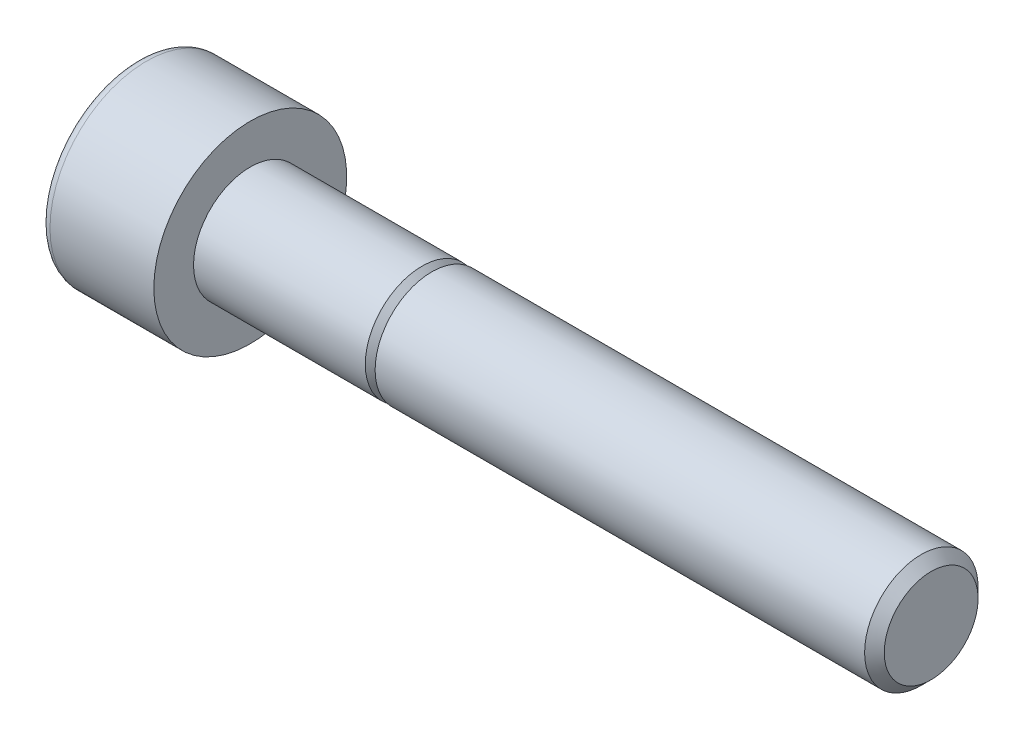
ISO-10303-21;
HEADER;
FILE_DESCRIPTION(('STEP AP214'),'2;1');
FILE_NAME('part.step','',(''),(''),'','','');
FILE_SCHEMA(('AUTOMOTIVE_DESIGN { 1 0 10303 214 1 1 1 1 }'));
ENDSEC;
DATA;
#1=APPLICATION_CONTEXT('core data for automotive mechanical design processes');
#2=APPLICATION_PROTOCOL_DEFINITION('international standard','automotive_design',2000,#1);
#3=PRODUCT_CONTEXT('',#1,'mechanical');
#4=PRODUCT('Part','Part','',(#3));
#5=PRODUCT_RELATED_PRODUCT_CATEGORY('part','',(#4));
#6=PRODUCT_DEFINITION_FORMATION('','',#4);
#7=PRODUCT_DEFINITION_CONTEXT('part definition',#1,'design');
#8=PRODUCT_DEFINITION('design','',#6,#7);
#9=PRODUCT_DEFINITION_SHAPE('','',#8);
#10=(LENGTH_UNIT() NAMED_UNIT(*) SI_UNIT(.MILLI.,.METRE.));
#11=(NAMED_UNIT(*) PLANE_ANGLE_UNIT() SI_UNIT($,.RADIAN.));
#12=(NAMED_UNIT(*) SI_UNIT($,.STERADIAN.) SOLID_ANGLE_UNIT());
#13=UNCERTAINTY_MEASURE_WITH_UNIT(LENGTH_MEASURE(1.E-05),#10,'distance_accuracy_value','');
#14=(GEOMETRIC_REPRESENTATION_CONTEXT(3) GLOBAL_UNCERTAINTY_ASSIGNED_CONTEXT((#13)) GLOBAL_UNIT_ASSIGNED_CONTEXT((#10,
#11,#12)) REPRESENTATION_CONTEXT('',''));
#15=CARTESIAN_POINT('',(0.,0.,0.));
#16=DIRECTION('',(0.,0.,1.));
#17=DIRECTION('',(1.,0.,0.));
#18=AXIS2_PLACEMENT_3D('',#15,#16,#17);
#19=CARTESIAN_POINT('',(0.,0.,0.));
#20=DIRECTION('',(-1.,0.,0.));
#21=DIRECTION('',(0.,0.,1.));
#22=AXIS2_PLACEMENT_3D('',#19,#20,#21);
#23=PLANE('',#22);
#24=CARTESIAN_POINT('',(0.,0.,0.));
#25=DIRECTION('',(-1.,0.,0.));
#26=DIRECTION('',(0.,0.,1.));
#27=AXIS2_PLACEMENT_3D('',#24,#25,#26);
#28=CIRCLE('',#27,4.25);
#29=CARTESIAN_POINT('',(0.,0.,4.25));
#30=VERTEX_POINT('',#29);
#31=EDGE_CURVE('E109',#30,#30,#28,.T.);
#32=ORIENTED_EDGE('',*,*,#31,.F.);
#33=EDGE_LOOP('',(#32));
#34=FACE_BOUND('',#33,.T.);
#35=CARTESIAN_POINT('',(0.,0.,0.));
#36=DIRECTION('',(-1.,0.,0.));
#37=DIRECTION('',(0.,0.,1.));
#38=AXIS2_PLACEMENT_3D('',#35,#36,#37);
#39=CIRCLE('',#38,2.5);
#40=CARTESIAN_POINT('',(0.,0.,2.5));
#41=VERTEX_POINT('',#40);
#42=EDGE_CURVE('E11',#41,#41,#39,.F.);
#43=ORIENTED_EDGE('',*,*,#42,.F.);
#44=EDGE_LOOP('',(#43));
#45=FACE_BOUND('',#44,.T.);
#46=ADVANCED_FACE('F16',(#34,#45),#23,.F.);
#47=CARTESIAN_POINT('',(-5.,3.825,0.));
#48=DIRECTION('',(1.,0.,0.));
#49=DIRECTION('',(0.,0.,-1.));
#50=AXIS2_PLACEMENT_3D('',#47,#48,#49);
#51=PLANE('',#50);
#52=CARTESIAN_POINT('',(-5.,0.,0.));
#53=DIRECTION('',(-1.,0.,0.));
#54=DIRECTION('',(0.,0.,1.));
#55=AXIS2_PLACEMENT_3D('',#52,#53,#54);
#56=CIRCLE('',#55,3.825);
#57=CARTESIAN_POINT('',(-5.,0.,3.825));
#58=VERTEX_POINT('',#57);
#59=EDGE_CURVE('E91',#58,#58,#56,.T.);
#60=ORIENTED_EDGE('',*,*,#59,.T.);
#61=EDGE_LOOP('',(#60));
#62=FACE_BOUND('',#61,.T.);
#63=DIRECTION('',(0.,0.5,0.866025403784438));
#64=VECTOR('',#63,1.);
#65=CARTESIAN_POINT('',(-5.,-0.775800807568874,2.65627358473774));
#66=LINE('',#65,#64);
#67=CARTESIAN_POINT('',(-5.,-2.30940107675851,0.));
#68=VERTEX_POINT('',#67);
#69=CARTESIAN_POINT('',(-5.,-1.15470053837925,2.));
#70=VERTEX_POINT('',#69);
#71=EDGE_CURVE('E25',#68,#70,#66,.T.);
#72=ORIENTED_EDGE('',*,*,#71,.F.);
#73=DIRECTION('',(0.,-0.5,0.866025403784439));
#74=VECTOR('',#73,1.);
#75=CARTESIAN_POINT('',(-5.,-0.775800807568879,-2.65627358473774));
#76=LINE('',#75,#74);
#77=CARTESIAN_POINT('',(-5.,-1.15470053837925,-2.));
#78=VERTEX_POINT('',#77);
#79=EDGE_CURVE('E40',#78,#68,#76,.T.);
#80=ORIENTED_EDGE('',*,*,#79,.F.);
#81=DIRECTION('',(0.,-1.,0.));
#82=VECTOR('',#81,1.);
#83=CARTESIAN_POINT('',(-5.,3.825,-2.));
#84=LINE('',#83,#82);
#85=CARTESIAN_POINT('',(-5.,1.15470053837925,-2.));
#86=VERTEX_POINT('',#85);
#87=EDGE_CURVE('E122',#86,#78,#84,.T.);
#88=ORIENTED_EDGE('',*,*,#87,.F.);
#89=DIRECTION('',(0.,-0.5,-0.866025403784439));
#90=VECTOR('',#89,1.);
#91=CARTESIAN_POINT('',(-5.,2.68830080756888,0.656273584737739));
#92=LINE('',#91,#90);
#93=CARTESIAN_POINT('',(-5.,2.30940107675851,0.));
#94=VERTEX_POINT('',#93);
#95=EDGE_CURVE('E119',#94,#86,#92,.T.);
#96=ORIENTED_EDGE('',*,*,#95,.F.);
#97=DIRECTION('',(0.,0.5,-0.866025403784439));
#98=VECTOR('',#97,1.);
#99=CARTESIAN_POINT('',(-5.,2.68830080756888,-0.656273584737739));
#100=LINE('',#99,#98);
#101=CARTESIAN_POINT('',(-5.,1.15470053837925,2.));
#102=VERTEX_POINT('',#101);
#103=EDGE_CURVE('E116',#102,#94,#100,.T.);
#104=ORIENTED_EDGE('',*,*,#103,.F.);
#105=DIRECTION('',(0.,1.,0.));
#106=VECTOR('',#105,1.);
#107=CARTESIAN_POINT('',(-5.,3.825,2.));
#108=LINE('',#107,#106);
#109=EDGE_CURVE('E113',#70,#102,#108,.T.);
#110=ORIENTED_EDGE('',*,*,#109,.F.);
#111=EDGE_LOOP('',(#72,#80,#88,#96,#104,#110));
#112=FACE_BOUND('',#111,.T.);
#113=ADVANCED_FACE('F18',(#62,#112),#51,.F.);
#114=CARTESIAN_POINT('',(-5.,0.,0.));
#115=DIRECTION('',(-1.,0.,0.));
#116=DIRECTION('',(0.,0.,1.));
#117=AXIS2_PLACEMENT_3D('',#114,#115,#116);
#118=CYLINDRICAL_SURFACE('',#117,4.25);
#119=CARTESIAN_POINT('',(-4.575,0.,0.));
#120=DIRECTION('',(-1.,0.,0.));
#121=DIRECTION('',(0.,0.,1.));
#122=AXIS2_PLACEMENT_3D('',#119,#120,#121);
#123=CIRCLE('',#122,4.25);
#124=CARTESIAN_POINT('',(-4.575,0.,4.25));
#125=VERTEX_POINT('',#124);
#126=EDGE_CURVE('E99',#125,#125,#123,.T.);
#127=ORIENTED_EDGE('',*,*,#126,.F.);
#128=EDGE_LOOP('',(#127));
#129=FACE_BOUND('',#128,.T.);
#130=ORIENTED_EDGE('',*,*,#31,.T.);
#131=EDGE_LOOP('',(#130));
#132=FACE_BOUND('',#131,.T.);
#133=ADVANCED_FACE('F238',(#129,#132),#118,.T.);
#134=CARTESIAN_POINT('',(-4.575,0.,0.));
#135=DIRECTION('',(-1.,0.,0.));
#136=DIRECTION('',(0.,0.,1.));
#137=AXIS2_PLACEMENT_3D('',#134,#135,#136);
#138=TOROIDAL_SURFACE('',#137,3.825,0.425);
#139=ORIENTED_EDGE('',*,*,#59,.F.);
#140=EDGE_LOOP('',(#139));
#141=FACE_BOUND('',#140,.T.);
#142=ORIENTED_EDGE('',*,*,#126,.T.);
#143=EDGE_LOOP('',(#142));
#144=FACE_BOUND('',#143,.T.);
#145=ADVANCED_FACE('F245',(#141,#144),#138,.T.);
#146=CARTESIAN_POINT('',(-2.5,-1.15470053837925,2.));
#147=DIRECTION('',(0.,0.866025403784438,-0.5));
#148=DIRECTION('',(0.,0.5,0.866025403784438));
#149=AXIS2_PLACEMENT_3D('',#146,#147,#148);
#150=PLANE('',#149);
#151=ORIENTED_EDGE('',*,*,#71,.T.);
#152=DIRECTION('',(-1.,0.,0.));
#153=VECTOR('',#152,1.);
#154=CARTESIAN_POINT('',(-2.5,-1.15470053837925,2.));
#155=LINE('',#154,#153);
#156=CARTESIAN_POINT('',(-2.5,-1.15470053837925,2.));
#157=VERTEX_POINT('',#156);
#158=EDGE_CURVE('E32',#157,#70,#155,.T.);
#159=ORIENTED_EDGE('',*,*,#158,.F.);
#160=DIRECTION('',(0.,-0.5,-0.866025403784439));
#161=VECTOR('',#160,1.);
#162=CARTESIAN_POINT('',(-2.5,-1.15470053837925,2.));
#163=LINE('',#162,#161);
#164=CARTESIAN_POINT('',(-2.5,-2.30940107675851,0.));
#165=VERTEX_POINT('',#164);
#166=EDGE_CURVE('E76',#157,#165,#163,.T.);
#167=ORIENTED_EDGE('',*,*,#166,.T.);
#168=DIRECTION('',(-1.,0.,0.));
#169=VECTOR('',#168,1.);
#170=CARTESIAN_POINT('',(-2.5,-2.30940107675851,0.));
#171=LINE('',#170,#169);
#172=EDGE_CURVE('E84',#165,#68,#171,.T.);
#173=ORIENTED_EDGE('',*,*,#172,.T.);
#174=EDGE_LOOP('',(#151,#159,#167,#173));
#175=FACE_BOUND('',#174,.T.);
#176=ADVANCED_FACE('F83',(#175),#150,.T.);
#177=CARTESIAN_POINT('',(-2.5,-2.30940107675851,0.));
#178=DIRECTION('',(0.,0.866025403784439,0.5));
#179=DIRECTION('',(0.,-0.5,0.866025403784439));
#180=AXIS2_PLACEMENT_3D('',#177,#178,#179);
#181=PLANE('',#180);
#182=ORIENTED_EDGE('',*,*,#79,.T.);
#183=ORIENTED_EDGE('',*,*,#172,.F.);
#184=DIRECTION('',(0.,0.5,-0.866025403784439));
#185=VECTOR('',#184,1.);
#186=CARTESIAN_POINT('',(-2.5,-2.30940107675851,0.));
#187=LINE('',#186,#185);
#188=CARTESIAN_POINT('',(-2.5,-1.15470053837925,-2.));
#189=VERTEX_POINT('',#188);
#190=EDGE_CURVE('E72',#165,#189,#187,.T.);
#191=ORIENTED_EDGE('',*,*,#190,.T.);
#192=DIRECTION('',(-1.,0.,0.));
#193=VECTOR('',#192,1.);
#194=CARTESIAN_POINT('',(-2.5,-1.15470053837925,-2.));
#195=LINE('',#194,#193);
#196=EDGE_CURVE('E92',#189,#78,#195,.T.);
#197=ORIENTED_EDGE('',*,*,#196,.T.);
#198=EDGE_LOOP('',(#182,#183,#191,#197));
#199=FACE_BOUND('',#198,.T.);
#200=ADVANCED_FACE('F89',(#199),#181,.T.);
#201=CARTESIAN_POINT('',(-2.5,-1.15470053837925,-2.));
#202=DIRECTION('',(0.,0.,1.));
#203=DIRECTION('',(0.,-1.,0.));
#204=AXIS2_PLACEMENT_3D('',#201,#202,#203);
#205=PLANE('',#204);
#206=ORIENTED_EDGE('',*,*,#87,.T.);
#207=ORIENTED_EDGE('',*,*,#196,.F.);
#208=DIRECTION('',(0.,1.,0.));
#209=VECTOR('',#208,1.);
#210=CARTESIAN_POINT('',(-2.5,-1.15470053837925,-2.));
#211=LINE('',#210,#209);
#212=CARTESIAN_POINT('',(-2.5,1.15470053837925,-2.));
#213=VERTEX_POINT('',#212);
#214=EDGE_CURVE('E78',#189,#213,#211,.T.);
#215=ORIENTED_EDGE('',*,*,#214,.T.);
#216=DIRECTION('',(-1.,0.,0.));
#217=VECTOR('',#216,1.);
#218=CARTESIAN_POINT('',(-2.5,1.15470053837925,-2.));
#219=LINE('',#218,#217);
#220=EDGE_CURVE('E102',#213,#86,#219,.T.);
#221=ORIENTED_EDGE('',*,*,#220,.T.);
#222=EDGE_LOOP('',(#206,#207,#215,#221));
#223=FACE_BOUND('',#222,.T.);
#224=ADVANCED_FACE('F161',(#223),#205,.T.);
#225=CARTESIAN_POINT('',(-2.5,1.15470053837925,-2.));
#226=DIRECTION('',(0.,-0.866025403784438,0.5));
#227=DIRECTION('',(0.,-0.5,-0.866025403784439));
#228=AXIS2_PLACEMENT_3D('',#225,#226,#227);
#229=PLANE('',#228);
#230=ORIENTED_EDGE('',*,*,#95,.T.);
#231=ORIENTED_EDGE('',*,*,#220,.F.);
#232=DIRECTION('',(0.,0.5,0.866025403784439));
#233=VECTOR('',#232,1.);
#234=CARTESIAN_POINT('',(-2.5,1.15470053837925,-2.));
#235=LINE('',#234,#233);
#236=CARTESIAN_POINT('',(-2.5,2.30940107675851,0.));
#237=VERTEX_POINT('',#236);
#238=EDGE_CURVE('E164',#213,#237,#235,.T.);
#239=ORIENTED_EDGE('',*,*,#238,.T.);
#240=DIRECTION('',(-1.,0.,0.));
#241=VECTOR('',#240,1.);
#242=CARTESIAN_POINT('',(-2.5,2.30940107675851,0.));
#243=LINE('',#242,#241);
#244=EDGE_CURVE('E143',#237,#94,#243,.T.);
#245=ORIENTED_EDGE('',*,*,#244,.T.);
#246=EDGE_LOOP('',(#230,#231,#239,#245));
#247=FACE_BOUND('',#246,.T.);
#248=ADVANCED_FACE('F163',(#247),#229,.T.);
#249=CARTESIAN_POINT('',(-2.5,2.30940107675851,0.));
#250=DIRECTION('',(0.,-0.866025403784439,-0.5));
#251=DIRECTION('',(0.,0.5,-0.866025403784439));
#252=AXIS2_PLACEMENT_3D('',#249,#250,#251);
#253=PLANE('',#252);
#254=ORIENTED_EDGE('',*,*,#103,.T.);
#255=ORIENTED_EDGE('',*,*,#244,.F.);
#256=DIRECTION('',(0.,-0.5,0.866025403784439));
#257=VECTOR('',#256,1.);
#258=CARTESIAN_POINT('',(-2.5,2.30940107675851,0.));
#259=LINE('',#258,#257);
#260=CARTESIAN_POINT('',(-2.5,1.15470053837925,2.));
#261=VERTEX_POINT('',#260);
#262=EDGE_CURVE('E141',#237,#261,#259,.T.);
#263=ORIENTED_EDGE('',*,*,#262,.T.);
#264=DIRECTION('',(-1.,0.,0.));
#265=VECTOR('',#264,1.);
#266=CARTESIAN_POINT('',(-2.5,1.15470053837925,2.));
#267=LINE('',#266,#265);
#268=EDGE_CURVE('E135',#261,#102,#267,.T.);
#269=ORIENTED_EDGE('',*,*,#268,.T.);
#270=EDGE_LOOP('',(#254,#255,#263,#269));
#271=FACE_BOUND('',#270,.T.);
#272=ADVANCED_FACE('F137',(#271),#253,.T.);
#273=CARTESIAN_POINT('',(-2.5,1.15470053837925,2.));
#274=DIRECTION('',(0.,0.,-1.));
#275=DIRECTION('',(0.,1.,0.));
#276=AXIS2_PLACEMENT_3D('',#273,#274,#275);
#277=PLANE('',#276);
#278=ORIENTED_EDGE('',*,*,#109,.T.);
#279=ORIENTED_EDGE('',*,*,#268,.F.);
#280=DIRECTION('',(0.,-1.,0.));
#281=VECTOR('',#280,1.);
#282=CARTESIAN_POINT('',(-2.5,1.15470053837925,2.));
#283=LINE('',#282,#281);
#284=EDGE_CURVE('E151',#261,#157,#283,.T.);
#285=ORIENTED_EDGE('',*,*,#284,.T.);
#286=ORIENTED_EDGE('',*,*,#158,.T.);
#287=EDGE_LOOP('',(#278,#279,#285,#286));
#288=FACE_BOUND('',#287,.T.);
#289=ADVANCED_FACE('F134',(#288),#277,.T.);
#290=CARTESIAN_POINT('',(-2.5,-2.30940107675851,0.));
#291=DIRECTION('',(1.,0.,0.));
#292=DIRECTION('',(0.,0.,1.));
#293=AXIS2_PLACEMENT_3D('',#290,#291,#292);
#294=PLANE('',#293);
#295=ORIENTED_EDGE('',*,*,#166,.F.);
#296=ORIENTED_EDGE('',*,*,#284,.F.);
#297=ORIENTED_EDGE('',*,*,#262,.F.);
#298=ORIENTED_EDGE('',*,*,#238,.F.);
#299=ORIENTED_EDGE('',*,*,#214,.F.);
#300=ORIENTED_EDGE('',*,*,#190,.F.);
#301=EDGE_LOOP('',(#295,#296,#297,#298,#299,#300));
#302=FACE_BOUND('',#301,.T.);
#303=ADVANCED_FACE('F74',(#302),#294,.F.);
#304=CARTESIAN_POINT('',(0.,0.,0.));
#305=DIRECTION('',(-1.,0.,0.));
#306=DIRECTION('',(0.,0.,1.));
#307=AXIS2_PLACEMENT_3D('',#304,#305,#306);
#308=CYLINDRICAL_SURFACE('',#307,2.5);
#309=CARTESIAN_POINT('',(7.567,0.,0.));
#310=DIRECTION('',(-1.,0.,0.));
#311=DIRECTION('',(0.,0.,1.));
#312=AXIS2_PLACEMENT_3D('',#309,#310,#311);
#313=CIRCLE('',#312,2.5);
#314=CARTESIAN_POINT('',(7.567,0.,2.5));
#315=VERTEX_POINT('',#314);
#316=EDGE_CURVE('E189',#315,#315,#313,.T.);
#317=ORIENTED_EDGE('',*,*,#316,.T.);
#318=EDGE_LOOP('',(#317));
#319=FACE_BOUND('',#318,.T.);
#320=ORIENTED_EDGE('',*,*,#42,.T.);
#321=EDGE_LOOP('',(#320));
#322=FACE_BOUND('',#321,.T.);
#323=ADVANCED_FACE('F197',(#319,#322),#308,.T.);
#324=CARTESIAN_POINT('',(30.,0.,0.));
#325=DIRECTION('',(-1.,0.,0.));
#326=DIRECTION('',(0.,0.,1.));
#327=AXIS2_PLACEMENT_3D('',#324,#325,#326);
#328=PLANE('',#327);
#329=CARTESIAN_POINT('',(30.,0.,0.));
#330=DIRECTION('',(-1.,0.,0.));
#331=DIRECTION('',(0.,0.,1.));
#332=AXIS2_PLACEMENT_3D('',#329,#330,#331);
#333=CIRCLE('',#332,2.067);
#334=CARTESIAN_POINT('',(30.,0.,2.067));
#335=VERTEX_POINT('',#334);
#336=EDGE_CURVE('E87',#335,#335,#333,.T.);
#337=ORIENTED_EDGE('',*,*,#336,.F.);
#338=EDGE_LOOP('',(#337));
#339=FACE_BOUND('',#338,.T.);
#340=ADVANCED_FACE('F221',(#339),#328,.F.);
#341=CARTESIAN_POINT('',(30.,0.,0.));
#342=DIRECTION('',(-1.,0.,0.));
#343=DIRECTION('',(0.,0.,1.));
#344=AXIS2_PLACEMENT_3D('',#341,#342,#343);
#345=CONICAL_SURFACE('',#344,2.067,0.785398163397449);
#346=CARTESIAN_POINT('',(29.567,0.,0.));
#347=DIRECTION('',(-1.,0.,0.));
#348=DIRECTION('',(0.,0.,1.));
#349=AXIS2_PLACEMENT_3D('',#346,#347,#348);
#350=CIRCLE('',#349,2.5);
#351=CARTESIAN_POINT('',(29.567,0.,2.5));
#352=VERTEX_POINT('',#351);
#353=EDGE_CURVE('E177',#352,#352,#350,.T.);
#354=ORIENTED_EDGE('',*,*,#353,.F.);
#355=EDGE_LOOP('',(#354));
#356=FACE_BOUND('',#355,.T.);
#357=ORIENTED_EDGE('',*,*,#336,.T.);
#358=EDGE_LOOP('',(#357));
#359=FACE_BOUND('',#358,.T.);
#360=ADVANCED_FACE('F215',(#356,#359),#345,.T.);
#361=CARTESIAN_POINT('',(0.,0.,0.));
#362=DIRECTION('',(-1.,0.,0.));
#363=DIRECTION('',(0.,0.,1.));
#364=AXIS2_PLACEMENT_3D('',#361,#362,#363);
#365=CYLINDRICAL_SURFACE('',#364,2.5);
#366=CARTESIAN_POINT('',(8.,0.,0.));
#367=DIRECTION('',(-1.,0.,0.));
#368=DIRECTION('',(0.,0.,1.));
#369=AXIS2_PLACEMENT_3D('',#366,#367,#368);
#370=CIRCLE('',#369,2.5);
#371=CARTESIAN_POINT('',(8.,0.,2.5));
#372=VERTEX_POINT('',#371);
#373=EDGE_CURVE('E181',#372,#372,#370,.T.);
#374=ORIENTED_EDGE('',*,*,#373,.F.);
#375=EDGE_LOOP('',(#374));
#376=FACE_BOUND('',#375,.T.);
#377=ORIENTED_EDGE('',*,*,#353,.T.);
#378=EDGE_LOOP('',(#377));
#379=FACE_BOUND('',#378,.T.);
#380=ADVANCED_FACE('F209',(#376,#379),#365,.T.);
#381=CARTESIAN_POINT('',(8.,2.5,0.));
#382=DIRECTION('',(1.,0.,0.));
#383=DIRECTION('',(0.,0.,-1.));
#384=AXIS2_PLACEMENT_3D('',#381,#382,#383);
#385=PLANE('',#384);
#386=CARTESIAN_POINT('',(8.,0.,0.));
#387=DIRECTION('',(-1.,0.,0.));
#388=DIRECTION('',(0.,0.,1.));
#389=AXIS2_PLACEMENT_3D('',#386,#387,#388);
#390=CIRCLE('',#389,2.067);
#391=CARTESIAN_POINT('',(8.,0.,2.067));
#392=VERTEX_POINT('',#391);
#393=EDGE_CURVE('E185',#392,#392,#390,.T.);
#394=ORIENTED_EDGE('',*,*,#393,.F.);
#395=EDGE_LOOP('',(#394));
#396=FACE_BOUND('',#395,.T.);
#397=ORIENTED_EDGE('',*,*,#373,.T.);
#398=EDGE_LOOP('',(#397));
#399=FACE_BOUND('',#398,.T.);
#400=ADVANCED_FACE('F203',(#396,#399),#385,.F.);
#401=CARTESIAN_POINT('',(8.,0.,0.));
#402=DIRECTION('',(-1.,0.,0.));
#403=DIRECTION('',(0.,0.,1.));
#404=AXIS2_PLACEMENT_3D('',#401,#402,#403);
#405=CONICAL_SURFACE('',#404,2.067,0.785398163397448);
#406=ORIENTED_EDGE('',*,*,#316,.F.);
#407=EDGE_LOOP('',(#406));
#408=FACE_BOUND('',#407,.T.);
#409=ORIENTED_EDGE('',*,*,#393,.T.);
#410=EDGE_LOOP('',(#409));
#411=FACE_BOUND('',#410,.T.);
#412=ADVANCED_FACE('F200',(#408,#411),#405,.T.);
#413=CLOSED_SHELL('',(#46,#113,#133,#145,#176,#200,#224,#248,#272,#289,#303,#323,#340,#360,#380,
#400,#412));
#414=MANIFOLD_SOLID_BREP('B1',#413);
#415=ADVANCED_BREP_SHAPE_REPRESENTATION('',(#18,#414),#14);
#416=SHAPE_DEFINITION_REPRESENTATION(#9,#415);
ENDSEC;
END-ISO-10303-21;
